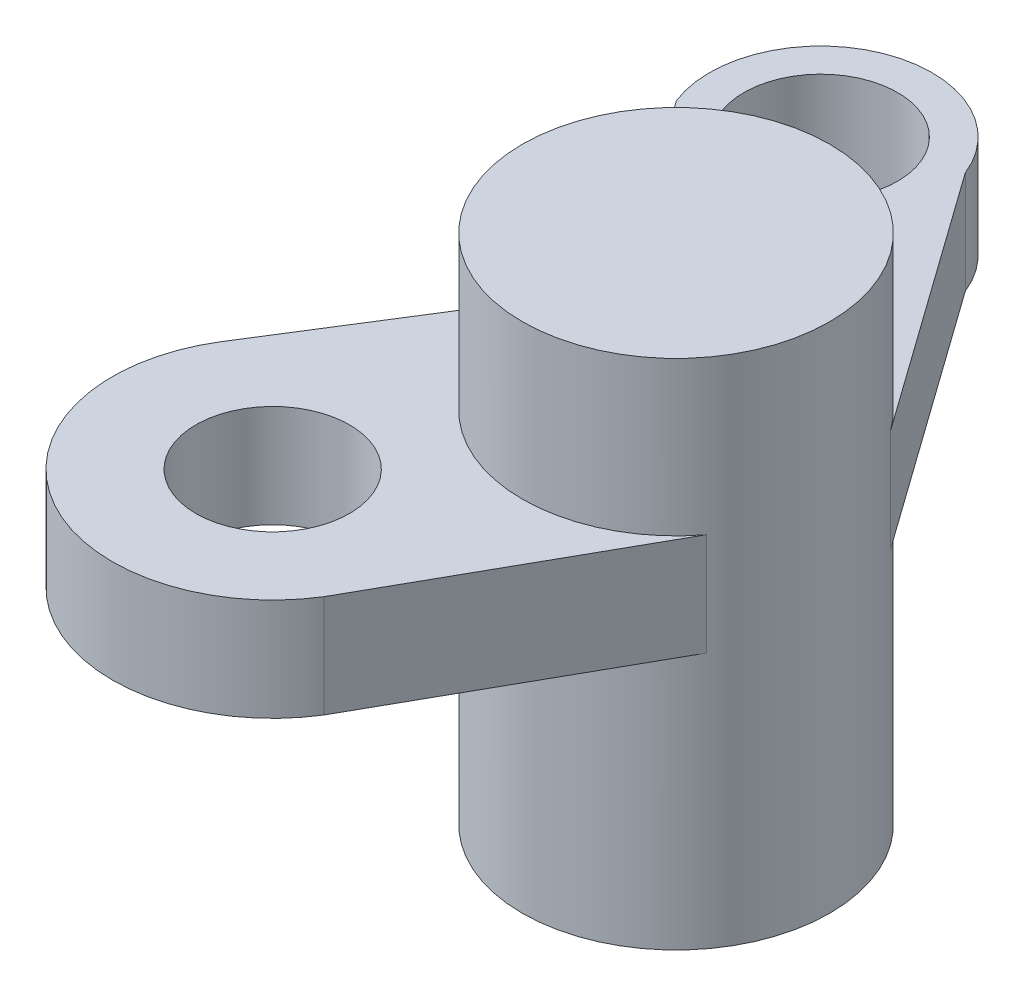
ISO-10303-21;
HEADER;
FILE_DESCRIPTION(('STEP AP214'),'2;1');
FILE_NAME('part.step','',(''),(''),'','','');
FILE_SCHEMA(('AUTOMOTIVE_DESIGN { 1 0 10303 214 1 1 1 1 }'));
ENDSEC;
DATA;
#1=APPLICATION_CONTEXT('core data for automotive mechanical design processes');
#2=APPLICATION_PROTOCOL_DEFINITION('international standard','automotive_design',2000,#1);
#3=PRODUCT_CONTEXT('',#1,'mechanical');
#4=PRODUCT('Part','Part','',(#3));
#5=PRODUCT_RELATED_PRODUCT_CATEGORY('part','',(#4));
#6=PRODUCT_DEFINITION_FORMATION('','',#4);
#7=PRODUCT_DEFINITION_CONTEXT('part definition',#1,'design');
#8=PRODUCT_DEFINITION('design','',#6,#7);
#9=PRODUCT_DEFINITION_SHAPE('','',#8);
#10=(LENGTH_UNIT() NAMED_UNIT(*) SI_UNIT(.MILLI.,.METRE.));
#11=(NAMED_UNIT(*) PLANE_ANGLE_UNIT() SI_UNIT($,.RADIAN.));
#12=(NAMED_UNIT(*) SI_UNIT($,.STERADIAN.) SOLID_ANGLE_UNIT());
#13=UNCERTAINTY_MEASURE_WITH_UNIT(LENGTH_MEASURE(1.E-05),#10,'distance_accuracy_value','');
#14=(GEOMETRIC_REPRESENTATION_CONTEXT(3) GLOBAL_UNCERTAINTY_ASSIGNED_CONTEXT((#13)) GLOBAL_UNIT_ASSIGNED_CONTEXT((#10,
#11,#12)) REPRESENTATION_CONTEXT('',''));
#15=CARTESIAN_POINT('',(0.,0.,0.));
#16=DIRECTION('',(0.,0.,1.));
#17=DIRECTION('',(1.,0.,0.));
#18=AXIS2_PLACEMENT_3D('',#15,#16,#17);
#19=CARTESIAN_POINT('',(-5.,10.,-2.));
#20=DIRECTION('',(0.,-1.,0.));
#21=DIRECTION('',(0.,0.,-1.));
#22=AXIS2_PLACEMENT_3D('',#19,#20,#21);
#23=CYLINDRICAL_SURFACE('',#22,3.);
#24=DIRECTION('',(0.,-1.,0.));
#25=VECTOR('',#24,1.);
#26=CARTESIAN_POINT('',(-2.5577995278444,7.,-3.74231364966328));
#27=LINE('',#26,#25);
#28=CARTESIAN_POINT('',(-2.5577995278444,7.,-3.74231364966328));
#29=VERTEX_POINT('',#28);
#30=CARTESIAN_POINT('',(-2.5577995278444,5.,-3.74231364966328));
#31=VERTEX_POINT('',#30);
#32=EDGE_CURVE('E142',#29,#31,#27,.T.);
#33=ORIENTED_EDGE('',*,*,#32,.F.);
#34=CARTESIAN_POINT('',(-5.,7.,-2.));
#35=DIRECTION('',(0.,1.,0.));
#36=DIRECTION('',(0.,0.,1.));
#37=AXIS2_PLACEMENT_3D('',#34,#35,#36);
#38=CIRCLE('',#37,3.);
#39=CARTESIAN_POINT('',(-7.54030512995444,7.,-3.59588528620547));
#40=VERTEX_POINT('',#39);
#41=EDGE_CURVE('E161',#29,#40,#38,.T.);
#42=ORIENTED_EDGE('',*,*,#41,.T.);
#43=CARTESIAN_POINT('',(-5.,7.,-2.));
#44=DIRECTION('',(0.,1.,0.));
#45=DIRECTION('',(0.,0.,1.));
#46=AXIS2_PLACEMENT_3D('',#43,#44,#45);
#47=CIRCLE('',#46,3.);
#48=CARTESIAN_POINT('',(-2.60451185063899,7.,-0.193999854299301));
#49=VERTEX_POINT('',#48);
#50=EDGE_CURVE('E80',#40,#49,#47,.T.);
#51=ORIENTED_EDGE('',*,*,#50,.T.);
#52=DIRECTION('',(0.,-1.,0.));
#53=VECTOR('',#52,1.);
#54=CARTESIAN_POINT('',(-2.60451185063899,7.,-0.193999854299294));
#55=LINE('',#54,#53);
#56=CARTESIAN_POINT('',(-2.60451185063899,5.,-0.193999854299294));
#57=VERTEX_POINT('',#56);
#58=EDGE_CURVE('E214',#49,#57,#55,.T.);
#59=ORIENTED_EDGE('',*,*,#58,.T.);
#60=CARTESIAN_POINT('',(-5.,5.,-2.));
#61=DIRECTION('',(0.,1.,0.));
#62=DIRECTION('',(0.,0.,1.));
#63=AXIS2_PLACEMENT_3D('',#60,#61,#62);
#64=CIRCLE('',#63,3.);
#65=CARTESIAN_POINT('',(-7.54030512995445,5.,-3.59588528620547));
#66=VERTEX_POINT('',#65);
#67=EDGE_CURVE('E178',#66,#57,#64,.T.);
#68=ORIENTED_EDGE('',*,*,#67,.F.);
#69=CARTESIAN_POINT('',(-5.,5.,-2.));
#70=DIRECTION('',(0.,1.,0.));
#71=DIRECTION('',(0.,0.,1.));
#72=AXIS2_PLACEMENT_3D('',#69,#70,#71);
#73=CIRCLE('',#72,3.);
#74=EDGE_CURVE('E88',#31,#66,#73,.T.);
#75=ORIENTED_EDGE('',*,*,#74,.F.);
#76=EDGE_LOOP('',(#33,#42,#51,#59,#68,#75));
#77=FACE_BOUND('',#76,.T.);
#78=CARTESIAN_POINT('',(-5.,10.,-2.));
#79=DIRECTION('',(0.,1.,0.));
#80=DIRECTION('',(0.,0.,1.));
#81=AXIS2_PLACEMENT_3D('',#78,#79,#80);
#82=CIRCLE('',#81,3.);
#83=CARTESIAN_POINT('',(-5.,10.,1.));
#84=VERTEX_POINT('',#83);
#85=EDGE_CURVE('E12',#84,#84,#82,.T.);
#86=ORIENTED_EDGE('',*,*,#85,.F.);
#87=EDGE_LOOP('',(#86));
#88=FACE_BOUND('',#87,.T.);
#89=CARTESIAN_POINT('',(-5.,0.,-2.));
#90=DIRECTION('',(0.,1.,0.));
#91=DIRECTION('',(0.,0.,1.));
#92=AXIS2_PLACEMENT_3D('',#89,#90,#91);
#93=CIRCLE('',#92,3.);
#94=CARTESIAN_POINT('',(-5.,0.,1.));
#95=VERTEX_POINT('',#94);
#96=EDGE_CURVE('E68',#95,#95,#93,.T.);
#97=ORIENTED_EDGE('',*,*,#96,.T.);
#98=EDGE_LOOP('',(#97));
#99=FACE_BOUND('',#98,.T.);
#100=ADVANCED_FACE('F65',(#77,#88,#99),#23,.T.);
#101=CARTESIAN_POINT('',(0.,10.,0.));
#102=DIRECTION('',(0.,1.,0.));
#103=DIRECTION('',(0.,0.,1.));
#104=AXIS2_PLACEMENT_3D('',#101,#102,#103);
#105=PLANE('',#104);
#106=ORIENTED_EDGE('',*,*,#85,.T.);
#107=EDGE_LOOP('',(#106));
#108=FACE_BOUND('',#107,.T.);
#109=ADVANCED_FACE('F233',(#108),#105,.T.);
#110=CARTESIAN_POINT('',(0.,0.,0.));
#111=DIRECTION('',(0.,1.,0.));
#112=DIRECTION('',(0.,0.,1.));
#113=AXIS2_PLACEMENT_3D('',#110,#111,#112);
#114=PLANE('',#113);
#115=ORIENTED_EDGE('',*,*,#96,.F.);
#116=EDGE_LOOP('',(#115));
#117=FACE_BOUND('',#116,.T.);
#118=ADVANCED_FACE('F230',(#117),#114,.F.);
#119=CARTESIAN_POINT('',(-7.02628534385417,7.,-4.41409390734849));
#120=DIRECTION('',(0.846768376651482,0.,0.531961762068491));
#121=DIRECTION('',(0.531961762068491,0.,-0.846768376651482));
#122=AXIS2_PLACEMENT_3D('',#119,#120,#121);
#123=PLANE('',#122);
#124=DIRECTION('',(-0.531961762068491,0.,0.846768376651482));
#125=VECTOR('',#124,1.);
#126=CARTESIAN_POINT('',(-7.02628534385417,5.,-4.41409390734849));
#127=LINE('',#126,#125);
#128=CARTESIAN_POINT('',(-10.5990672221085,5.,1.27300416416613));
#129=VERTEX_POINT('',#128);
#130=EDGE_CURVE('E196',#66,#129,#127,.T.);
#131=ORIENTED_EDGE('',*,*,#130,.T.);
#132=DIRECTION('',(0.,-1.,0.));
#133=VECTOR('',#132,1.);
#134=CARTESIAN_POINT('',(-10.5990672221085,7.,1.27300416416613));
#135=LINE('',#134,#133);
#136=CARTESIAN_POINT('',(-10.5990672221085,7.,1.27300416416613));
#137=VERTEX_POINT('',#136);
#138=EDGE_CURVE('E220',#137,#129,#135,.T.);
#139=ORIENTED_EDGE('',*,*,#138,.F.);
#140=DIRECTION('',(-0.531961762068491,0.,0.846768376651482));
#141=VECTOR('',#140,1.);
#142=CARTESIAN_POINT('',(-7.02628534385417,7.,-4.41409390734849));
#143=LINE('',#142,#141);
#144=EDGE_CURVE('E177',#40,#137,#143,.T.);
#145=ORIENTED_EDGE('',*,*,#144,.F.);
#146=DIRECTION('',(0.,-1.,0.));
#147=VECTOR('',#146,1.);
#148=CARTESIAN_POINT('',(-7.54030512995444,7.,-3.59588528620547));
#149=LINE('',#148,#147);
#150=EDGE_CURVE('E191',#40,#66,#149,.T.);
#151=ORIENTED_EDGE('',*,*,#150,.T.);
#152=EDGE_LOOP('',(#131,#139,#145,#151));
#153=FACE_BOUND('',#152,.T.);
#154=ADVANCED_FACE('F232',(#153),#123,.F.);
#155=CARTESIAN_POINT('',(-7.94375553879143,7.,2.92904355305522));
#156=DIRECTION('',(0.,-1.,0.));
#157=DIRECTION('',(0.,0.,-1.));
#158=AXIS2_PLACEMENT_3D('',#155,#156,#157);
#159=CYLINDRICAL_SURFACE('',#158,3.12940035679556);
#160=CARTESIAN_POINT('',(-7.94375553879143,5.,2.92904355305522));
#161=DIRECTION('',(0.,1.,0.));
#162=DIRECTION('',(0.,0.,1.));
#163=AXIS2_PLACEMENT_3D('',#160,#161,#162);
#164=CIRCLE('',#163,3.12940035679556);
#165=CARTESIAN_POINT('',(-5.28844385547438,5.,4.58508294194432));
#166=VERTEX_POINT('',#165);
#167=EDGE_CURVE('E200',#129,#166,#164,.T.);
#168=ORIENTED_EDGE('',*,*,#167,.T.);
#169=DIRECTION('',(0.,-1.,0.));
#170=VECTOR('',#169,1.);
#171=CARTESIAN_POINT('',(-5.28844385547438,7.,4.58508294194432));
#172=LINE('',#171,#170);
#173=CARTESIAN_POINT('',(-5.28844385547438,7.,4.58508294194432));
#174=VERTEX_POINT('',#173);
#175=EDGE_CURVE('E217',#174,#166,#172,.T.);
#176=ORIENTED_EDGE('',*,*,#175,.F.);
#177=CARTESIAN_POINT('',(-7.94375553879143,7.,2.92904355305522));
#178=DIRECTION('',(0.,1.,0.));
#179=DIRECTION('',(0.,0.,1.));
#180=AXIS2_PLACEMENT_3D('',#177,#178,#179);
#181=CIRCLE('',#180,3.12940035679556);
#182=EDGE_CURVE('E182',#137,#174,#181,.T.);
#183=ORIENTED_EDGE('',*,*,#182,.F.);
#184=ORIENTED_EDGE('',*,*,#138,.T.);
#185=EDGE_LOOP('',(#168,#176,#183,#184));
#186=FACE_BOUND('',#185,.T.);
#187=ADVANCED_FACE('F238',(#186),#159,.T.);
#188=CARTESIAN_POINT('',(-2.06285068241814,7.,-1.15849655755919));
#189=DIRECTION('',(0.871910713316475,0.,0.489664893579226));
#190=DIRECTION('',(0.489664893579226,0.,-0.871910713316475));
#191=AXIS2_PLACEMENT_3D('',#188,#189,#190);
#192=PLANE('',#191);
#193=DIRECTION('',(-0.489664893579226,0.,0.871910713316475));
#194=VECTOR('',#193,1.);
#195=CARTESIAN_POINT('',(-2.06285068241814,5.,-1.15849655755919));
#196=LINE('',#195,#194);
#197=EDGE_CURVE('E204',#57,#166,#196,.T.);
#198=ORIENTED_EDGE('',*,*,#197,.F.);
#199=ORIENTED_EDGE('',*,*,#58,.F.);
#200=DIRECTION('',(-0.489664893579226,0.,0.871910713316475));
#201=VECTOR('',#200,1.);
#202=CARTESIAN_POINT('',(-2.06285068241814,7.,-1.15849655755919));
#203=LINE('',#202,#201);
#204=EDGE_CURVE('E185',#49,#174,#203,.T.);
#205=ORIENTED_EDGE('',*,*,#204,.T.);
#206=ORIENTED_EDGE('',*,*,#175,.T.);
#207=EDGE_LOOP('',(#198,#199,#205,#206));
#208=FACE_BOUND('',#207,.T.);
#209=ADVANCED_FACE('F282',(#208),#192,.T.);
#210=CARTESIAN_POINT('',(-7.94375553879143,7.,2.92904355305522));
#211=DIRECTION('',(0.,-1.,0.));
#212=DIRECTION('',(0.,0.,-1.));
#213=AXIS2_PLACEMENT_3D('',#210,#211,#212);
#214=CYLINDRICAL_SURFACE('',#213,1.5);
#215=CARTESIAN_POINT('',(-7.94375553879143,7.,2.92904355305522));
#216=DIRECTION('',(0.,1.,0.));
#217=DIRECTION('',(0.,0.,1.));
#218=AXIS2_PLACEMENT_3D('',#215,#216,#217);
#219=CIRCLE('',#218,1.5);
#220=CARTESIAN_POINT('',(-7.94375553879143,7.,4.42904355305522));
#221=VERTEX_POINT('',#220);
#222=EDGE_CURVE('E173',#221,#221,#219,.T.);
#223=ORIENTED_EDGE('',*,*,#222,.T.);
#224=EDGE_LOOP('',(#223));
#225=FACE_BOUND('',#224,.T.);
#226=CARTESIAN_POINT('',(-7.94375553879143,5.,2.92904355305522));
#227=DIRECTION('',(0.,1.,0.));
#228=DIRECTION('',(0.,0.,1.));
#229=AXIS2_PLACEMENT_3D('',#226,#227,#228);
#230=CIRCLE('',#229,1.5);
#231=CARTESIAN_POINT('',(-7.94375553879143,5.,4.42904355305522));
#232=VERTEX_POINT('',#231);
#233=EDGE_CURVE('E192',#232,#232,#230,.T.);
#234=ORIENTED_EDGE('',*,*,#233,.F.);
#235=EDGE_LOOP('',(#234));
#236=FACE_BOUND('',#235,.T.);
#237=ADVANCED_FACE('F277',(#225,#236),#214,.F.);
#238=CARTESIAN_POINT('',(0.,7.,0.));
#239=DIRECTION('',(0.,1.,0.));
#240=DIRECTION('',(0.,0.,1.));
#241=AXIS2_PLACEMENT_3D('',#238,#239,#240);
#242=PLANE('',#241);
#243=ORIENTED_EDGE('',*,*,#222,.F.);
#244=EDGE_LOOP('',(#243));
#245=FACE_BOUND('',#244,.T.);
#246=ORIENTED_EDGE('',*,*,#144,.T.);
#247=ORIENTED_EDGE('',*,*,#182,.T.);
#248=ORIENTED_EDGE('',*,*,#204,.F.);
#249=ORIENTED_EDGE('',*,*,#50,.F.);
#250=EDGE_LOOP('',(#246,#247,#248,#249));
#251=FACE_BOUND('',#250,.T.);
#252=ADVANCED_FACE('F273',(#245,#251),#242,.T.);
#253=CARTESIAN_POINT('',(0.,5.,0.));
#254=DIRECTION('',(0.,1.,0.));
#255=DIRECTION('',(0.,0.,1.));
#256=AXIS2_PLACEMENT_3D('',#253,#254,#255);
#257=PLANE('',#256);
#258=ORIENTED_EDGE('',*,*,#233,.T.);
#259=EDGE_LOOP('',(#258));
#260=FACE_BOUND('',#259,.T.);
#261=ORIENTED_EDGE('',*,*,#130,.F.);
#262=ORIENTED_EDGE('',*,*,#67,.T.);
#263=ORIENTED_EDGE('',*,*,#197,.T.);
#264=ORIENTED_EDGE('',*,*,#167,.F.);
#265=EDGE_LOOP('',(#261,#262,#263,#264));
#266=FACE_BOUND('',#265,.T.);
#267=ADVANCED_FACE('F276',(#260,#266),#257,.F.);
#268=CARTESIAN_POINT('',(-8.21170301216726,7.,-8.03596178636058));
#269=DIRECTION('',(0.,-1.,0.));
#270=DIRECTION('',(0.,0.,-1.));
#271=AXIS2_PLACEMENT_3D('',#268,#269,#270);
#272=CYLINDRICAL_SURFACE('',#271,2.17232490865918);
#273=CARTESIAN_POINT('',(-8.21170301216726,5.,-8.03596178636058));
#274=DIRECTION('',(0.,1.,0.));
#275=DIRECTION('',(0.,0.,1.));
#276=AXIS2_PLACEMENT_3D('',#273,#274,#275);
#277=CIRCLE('',#276,2.17232490865918);
#278=CARTESIAN_POINT('',(-10.23092663751,5.,-7.23488035501988));
#279=VERTEX_POINT('',#278);
#280=CARTESIAN_POINT('',(-6.19247938682453,5.,-8.83704321770128));
#281=VERTEX_POINT('',#280);
#282=EDGE_CURVE('E132',#279,#281,#277,.F.);
#283=ORIENTED_EDGE('',*,*,#282,.F.);
#284=DIRECTION('',(0.,-1.,0.));
#285=VECTOR('',#284,1.);
#286=CARTESIAN_POINT('',(-10.23092663751,7.,-7.23488035501988));
#287=LINE('',#286,#285);
#288=CARTESIAN_POINT('',(-10.23092663751,7.,-7.23488035501988));
#289=VERTEX_POINT('',#288);
#290=EDGE_CURVE('E164',#289,#279,#287,.T.);
#291=ORIENTED_EDGE('',*,*,#290,.F.);
#292=CARTESIAN_POINT('',(-8.21170301216726,7.,-8.03596178636058));
#293=DIRECTION('',(0.,1.,0.));
#294=DIRECTION('',(0.,0.,1.));
#295=AXIS2_PLACEMENT_3D('',#292,#293,#294);
#296=CIRCLE('',#295,2.17232490865918);
#297=CARTESIAN_POINT('',(-6.19247938682453,7.,-8.83704321770128));
#298=VERTEX_POINT('',#297);
#299=EDGE_CURVE('E134',#289,#298,#296,.F.);
#300=ORIENTED_EDGE('',*,*,#299,.T.);
#301=DIRECTION('',(0.,-1.,0.));
#302=VECTOR('',#301,1.);
#303=CARTESIAN_POINT('',(-6.19247938682453,7.,-8.83704321770128));
#304=LINE('',#303,#302);
#305=EDGE_CURVE('E128',#298,#281,#304,.T.);
#306=ORIENTED_EDGE('',*,*,#305,.T.);
#307=EDGE_LOOP('',(#283,#291,#300,#306));
#308=FACE_BOUND('',#307,.T.);
#309=ADVANCED_FACE('F130',(#308),#272,.T.);
#310=CARTESIAN_POINT('',(-3.15612941073061,7.,2.33359746648601));
#311=DIRECTION('',(-0.804077958050247,0.,0.59452387452292));
#312=DIRECTION('',(0.59452387452292,0.,0.804077958050247));
#313=AXIS2_PLACEMENT_3D('',#310,#311,#312);
#314=PLANE('',#313);
#315=DIRECTION('',(-0.59452387452292,0.,-0.804077958050247));
#316=VECTOR('',#315,1.);
#317=CARTESIAN_POINT('',(-3.15612941073061,5.,2.33359746648601));
#318=LINE('',#317,#316);
#319=EDGE_CURVE('E147',#66,#279,#318,.T.);
#320=ORIENTED_EDGE('',*,*,#319,.F.);
#321=ORIENTED_EDGE('',*,*,#150,.F.);
#322=DIRECTION('',(-0.59452387452292,0.,-0.804077958050247));
#323=VECTOR('',#322,1.);
#324=CARTESIAN_POINT('',(-3.15612941073061,7.,2.33359746648601));
#325=LINE('',#324,#323);
#326=EDGE_CURVE('E137',#40,#289,#325,.T.);
#327=ORIENTED_EDGE('',*,*,#326,.T.);
#328=ORIENTED_EDGE('',*,*,#290,.T.);
#329=EDGE_LOOP('',(#320,#321,#327,#328));
#330=FACE_BOUND('',#329,.T.);
#331=ADVANCED_FACE('F256',(#330),#314,.T.);
#332=CARTESIAN_POINT('',(-8.21170301216726,7.,-8.03596178636058));
#333=DIRECTION('',(0.,-1.,0.));
#334=DIRECTION('',(0.,0.,-1.));
#335=AXIS2_PLACEMENT_3D('',#332,#333,#334);
#336=CYLINDRICAL_SURFACE('',#335,1.5);
#337=CARTESIAN_POINT('',(-8.21170301216726,7.,-8.03596178636058));
#338=DIRECTION('',(0.,1.,0.));
#339=DIRECTION('',(0.,0.,1.));
#340=AXIS2_PLACEMENT_3D('',#337,#338,#339);
#341=CIRCLE('',#340,1.5);
#342=CARTESIAN_POINT('',(-8.21170301216726,7.,-6.53596178636058));
#343=VERTEX_POINT('',#342);
#344=EDGE_CURVE('E144',#343,#343,#341,.T.);
#345=ORIENTED_EDGE('',*,*,#344,.T.);
#346=EDGE_LOOP('',(#345));
#347=FACE_BOUND('',#346,.T.);
#348=CARTESIAN_POINT('',(-8.21170301216726,5.,-8.03596178636058));
#349=DIRECTION('',(0.,1.,0.));
#350=DIRECTION('',(0.,0.,1.));
#351=AXIS2_PLACEMENT_3D('',#348,#349,#350);
#352=CIRCLE('',#351,1.5);
#353=CARTESIAN_POINT('',(-8.21170301216726,5.,-6.53596178636058));
#354=VERTEX_POINT('',#353);
#355=EDGE_CURVE('E149',#354,#354,#352,.T.);
#356=ORIENTED_EDGE('',*,*,#355,.F.);
#357=EDGE_LOOP('',(#356));
#358=FACE_BOUND('',#357,.T.);
#359=ADVANCED_FACE('F269',(#347,#358),#336,.F.);
#360=CARTESIAN_POINT('',(0.0742496615685398,7.,-0.0529711628134939));
#361=DIRECTION('',(-0.814066824051866,0.,0.580771216554426));
#362=DIRECTION('',(0.580771216554426,0.,0.814066824051866));
#363=AXIS2_PLACEMENT_3D('',#360,#361,#362);
#364=PLANE('',#363);
#365=DIRECTION('',(-0.580771216554426,0.,-0.814066824051866));
#366=VECTOR('',#365,1.);
#367=CARTESIAN_POINT('',(0.0742496615685398,5.,-0.0529711628134939));
#368=LINE('',#367,#366);
#369=EDGE_CURVE('E139',#31,#281,#368,.T.);
#370=ORIENTED_EDGE('',*,*,#369,.T.);
#371=ORIENTED_EDGE('',*,*,#305,.F.);
#372=DIRECTION('',(-0.580771216554426,0.,-0.814066824051866));
#373=VECTOR('',#372,1.);
#374=CARTESIAN_POINT('',(0.0742496615685398,7.,-0.0529711628134939));
#375=LINE('',#374,#373);
#376=EDGE_CURVE('E155',#29,#298,#375,.T.);
#377=ORIENTED_EDGE('',*,*,#376,.F.);
#378=ORIENTED_EDGE('',*,*,#32,.T.);
#379=EDGE_LOOP('',(#370,#371,#377,#378));
#380=FACE_BOUND('',#379,.T.);
#381=ADVANCED_FACE('F140',(#380),#364,.F.);
#382=CARTESIAN_POINT('',(0.,7.,0.));
#383=DIRECTION('',(0.,1.,0.));
#384=DIRECTION('',(0.,0.,1.));
#385=AXIS2_PLACEMENT_3D('',#382,#383,#384);
#386=PLANE('',#385);
#387=ORIENTED_EDGE('',*,*,#344,.F.);
#388=EDGE_LOOP('',(#387));
#389=FACE_BOUND('',#388,.T.);
#390=ORIENTED_EDGE('',*,*,#299,.F.);
#391=ORIENTED_EDGE('',*,*,#326,.F.);
#392=ORIENTED_EDGE('',*,*,#41,.F.);
#393=ORIENTED_EDGE('',*,*,#376,.T.);
#394=EDGE_LOOP('',(#390,#391,#392,#393));
#395=FACE_BOUND('',#394,.T.);
#396=ADVANCED_FACE('F259',(#389,#395),#386,.T.);
#397=CARTESIAN_POINT('',(0.,5.,0.));
#398=DIRECTION('',(0.,1.,0.));
#399=DIRECTION('',(0.,0.,1.));
#400=AXIS2_PLACEMENT_3D('',#397,#398,#399);
#401=PLANE('',#400);
#402=ORIENTED_EDGE('',*,*,#355,.T.);
#403=EDGE_LOOP('',(#402));
#404=FACE_BOUND('',#403,.T.);
#405=ORIENTED_EDGE('',*,*,#282,.T.);
#406=ORIENTED_EDGE('',*,*,#369,.F.);
#407=ORIENTED_EDGE('',*,*,#74,.T.);
#408=ORIENTED_EDGE('',*,*,#319,.T.);
#409=EDGE_LOOP('',(#405,#406,#407,#408));
#410=FACE_BOUND('',#409,.T.);
#411=ADVANCED_FACE('F146',(#404,#410),#401,.F.);
#412=CLOSED_SHELL('',(#100,#109,#118,#154,#187,#209,#237,#252,#267,#309,#331,#359,#381,#396,#411));
#413=MANIFOLD_SOLID_BREP('B2',#412);
#414=ADVANCED_BREP_SHAPE_REPRESENTATION('',(#18,#413),#14);
#415=SHAPE_DEFINITION_REPRESENTATION(#9,#414);
ENDSEC;
END-ISO-10303-21;
